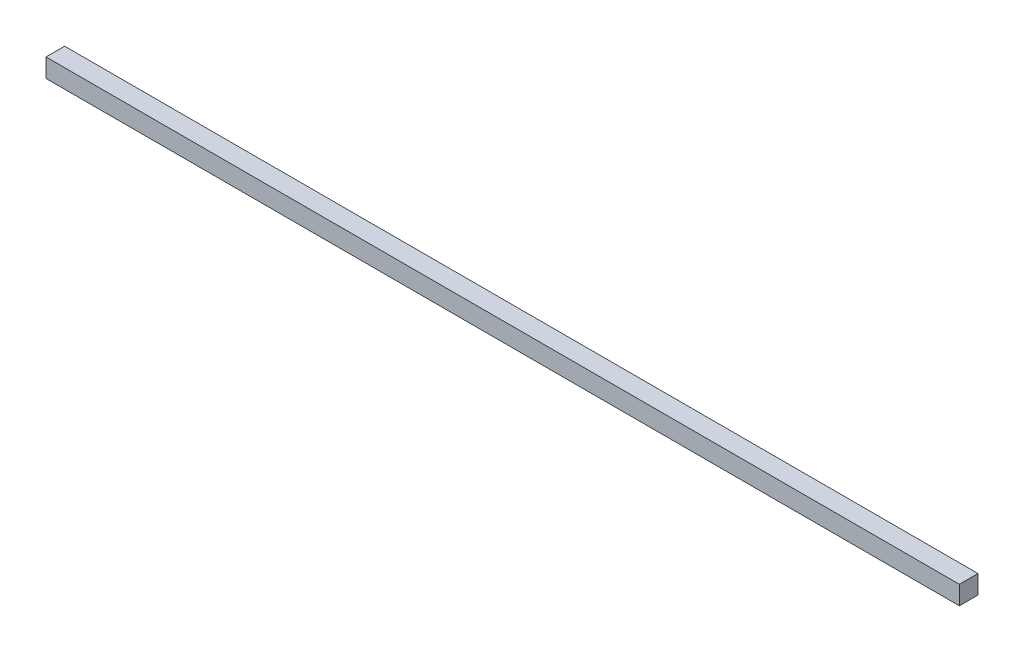
ISO-10303-21;
HEADER;
FILE_DESCRIPTION(('STEP AP214'),'2;1');
FILE_NAME('part.step','',(''),(''),'','','');
FILE_SCHEMA(('AUTOMOTIVE_DESIGN { 1 0 10303 214 1 1 1 1 }'));
ENDSEC;
DATA;
#1=APPLICATION_CONTEXT('core data for automotive mechanical design processes');
#2=APPLICATION_PROTOCOL_DEFINITION('international standard','automotive_design',2000,#1);
#3=PRODUCT_CONTEXT('',#1,'mechanical');
#4=PRODUCT('Part','Part','',(#3));
#5=PRODUCT_RELATED_PRODUCT_CATEGORY('part','',(#4));
#6=PRODUCT_DEFINITION_FORMATION('','',#4);
#7=PRODUCT_DEFINITION_CONTEXT('part definition',#1,'design');
#8=PRODUCT_DEFINITION('design','',#6,#7);
#9=PRODUCT_DEFINITION_SHAPE('','',#8);
#10=(LENGTH_UNIT() NAMED_UNIT(*) SI_UNIT(.MILLI.,.METRE.));
#11=(NAMED_UNIT(*) PLANE_ANGLE_UNIT() SI_UNIT($,.RADIAN.));
#12=(NAMED_UNIT(*) SI_UNIT($,.STERADIAN.) SOLID_ANGLE_UNIT());
#13=UNCERTAINTY_MEASURE_WITH_UNIT(LENGTH_MEASURE(1.E-05),#10,'distance_accuracy_value','');
#14=(GEOMETRIC_REPRESENTATION_CONTEXT(3) GLOBAL_UNCERTAINTY_ASSIGNED_CONTEXT((#13)) GLOBAL_UNIT_ASSIGNED_CONTEXT((#10,
#11,#12)) REPRESENTATION_CONTEXT('',''));
#15=CARTESIAN_POINT('',(0.,0.,0.));
#16=DIRECTION('',(0.,0.,1.));
#17=DIRECTION('',(1.,0.,0.));
#18=AXIS2_PLACEMENT_3D('',#15,#16,#17);
#19=CARTESIAN_POINT('',(600.,24.5,-12.25));
#20=DIRECTION('',(-1.,0.,0.));
#21=DIRECTION('',(0.,0.,1.));
#22=AXIS2_PLACEMENT_3D('',#19,#20,#21);
#23=PLANE('',#22);
#24=DIRECTION('',(0.,0.,-1.));
#25=VECTOR('',#24,1.);
#26=CARTESIAN_POINT('',(600.,0.,-12.25));
#27=LINE('',#26,#25);
#28=CARTESIAN_POINT('',(600.,0.,12.25));
#29=VERTEX_POINT('',#28);
#30=CARTESIAN_POINT('',(600.,0.,-12.25));
#31=VERTEX_POINT('',#30);
#32=EDGE_CURVE('E107',#29,#31,#27,.T.);
#33=ORIENTED_EDGE('',*,*,#32,.T.);
#34=DIRECTION('',(0.,-1.,0.));
#35=VECTOR('',#34,1.);
#36=CARTESIAN_POINT('',(600.,24.5,-12.25));
#37=LINE('',#36,#35);
#38=CARTESIAN_POINT('',(600.,24.5,-12.25));
#39=VERTEX_POINT('',#38);
#40=EDGE_CURVE('E11',#39,#31,#37,.T.);
#41=ORIENTED_EDGE('',*,*,#40,.F.);
#42=DIRECTION('',(0.,0.,-1.));
#43=VECTOR('',#42,1.);
#44=CARTESIAN_POINT('',(600.,24.5,-12.25));
#45=LINE('',#44,#43);
#46=CARTESIAN_POINT('',(600.,24.5,12.25));
#47=VERTEX_POINT('',#46);
#48=EDGE_CURVE('E91',#47,#39,#45,.T.);
#49=ORIENTED_EDGE('',*,*,#48,.F.);
#50=DIRECTION('',(0.,-1.,0.));
#51=VECTOR('',#50,1.);
#52=CARTESIAN_POINT('',(600.,24.5,12.25));
#53=LINE('',#52,#51);
#54=EDGE_CURVE('E103',#47,#29,#53,.T.);
#55=ORIENTED_EDGE('',*,*,#54,.T.);
#56=EDGE_LOOP('',(#33,#41,#49,#55));
#57=FACE_BOUND('',#56,.T.);
#58=ADVANCED_FACE('F39',(#57),#23,.F.);
#59=CARTESIAN_POINT('',(-600.,24.5,-12.25));
#60=DIRECTION('',(0.,0.,1.));
#61=DIRECTION('',(1.,0.,0.));
#62=AXIS2_PLACEMENT_3D('',#59,#60,#61);
#63=PLANE('',#62);
#64=DIRECTION('',(-1.,0.,0.));
#65=VECTOR('',#64,1.);
#66=CARTESIAN_POINT('',(-600.,0.,-12.25));
#67=LINE('',#66,#65);
#68=CARTESIAN_POINT('',(-600.,0.,-12.25));
#69=VERTEX_POINT('',#68);
#70=EDGE_CURVE('E96',#31,#69,#67,.T.);
#71=ORIENTED_EDGE('',*,*,#70,.T.);
#72=DIRECTION('',(0.,-1.,0.));
#73=VECTOR('',#72,1.);
#74=CARTESIAN_POINT('',(-600.,24.5,-12.25));
#75=LINE('',#74,#73);
#76=CARTESIAN_POINT('',(-600.,24.5,-12.25));
#77=VERTEX_POINT('',#76);
#78=EDGE_CURVE('E48',#77,#69,#75,.T.);
#79=ORIENTED_EDGE('',*,*,#78,.F.);
#80=DIRECTION('',(-1.,0.,0.));
#81=VECTOR('',#80,1.);
#82=CARTESIAN_POINT('',(-600.,24.5,-12.25));
#83=LINE('',#82,#81);
#84=EDGE_CURVE('E86',#39,#77,#83,.T.);
#85=ORIENTED_EDGE('',*,*,#84,.F.);
#86=ORIENTED_EDGE('',*,*,#40,.T.);
#87=EDGE_LOOP('',(#71,#79,#85,#86));
#88=FACE_BOUND('',#87,.T.);
#89=ADVANCED_FACE('F95',(#88),#63,.F.);
#90=CARTESIAN_POINT('',(-600.,24.5,-12.25));
#91=DIRECTION('',(1.,0.,0.));
#92=DIRECTION('',(0.,0.,-1.));
#93=AXIS2_PLACEMENT_3D('',#90,#91,#92);
#94=PLANE('',#93);
#95=DIRECTION('',(0.,0.,1.));
#96=VECTOR('',#95,1.);
#97=CARTESIAN_POINT('',(-600.,0.,-12.25));
#98=LINE('',#97,#96);
#99=CARTESIAN_POINT('',(-600.,0.,12.25));
#100=VERTEX_POINT('',#99);
#101=EDGE_CURVE('E73',#69,#100,#98,.T.);
#102=ORIENTED_EDGE('',*,*,#101,.T.);
#103=DIRECTION('',(0.,-1.,0.));
#104=VECTOR('',#103,1.);
#105=CARTESIAN_POINT('',(-600.,24.5,12.25));
#106=LINE('',#105,#104);
#107=CARTESIAN_POINT('',(-600.,24.5,12.25));
#108=VERTEX_POINT('',#107);
#109=EDGE_CURVE('E98',#108,#100,#106,.T.);
#110=ORIENTED_EDGE('',*,*,#109,.F.);
#111=DIRECTION('',(0.,0.,1.));
#112=VECTOR('',#111,1.);
#113=CARTESIAN_POINT('',(-600.,24.5,-12.25));
#114=LINE('',#113,#112);
#115=EDGE_CURVE('E89',#77,#108,#114,.T.);
#116=ORIENTED_EDGE('',*,*,#115,.F.);
#117=ORIENTED_EDGE('',*,*,#78,.T.);
#118=EDGE_LOOP('',(#102,#110,#116,#117));
#119=FACE_BOUND('',#118,.T.);
#120=ADVANCED_FACE('F99',(#119),#94,.F.);
#121=CARTESIAN_POINT('',(-600.,24.5,12.25));
#122=DIRECTION('',(0.,0.,-1.));
#123=DIRECTION('',(-1.,0.,0.));
#124=AXIS2_PLACEMENT_3D('',#121,#122,#123);
#125=PLANE('',#124);
#126=DIRECTION('',(1.,0.,0.));
#127=VECTOR('',#126,1.);
#128=CARTESIAN_POINT('',(-600.,0.,12.25));
#129=LINE('',#128,#127);
#130=EDGE_CURVE('E79',#100,#29,#129,.T.);
#131=ORIENTED_EDGE('',*,*,#130,.T.);
#132=ORIENTED_EDGE('',*,*,#54,.F.);
#133=DIRECTION('',(1.,0.,0.));
#134=VECTOR('',#133,1.);
#135=CARTESIAN_POINT('',(-600.,24.5,12.25));
#136=LINE('',#135,#134);
#137=EDGE_CURVE('E56',#108,#47,#136,.T.);
#138=ORIENTED_EDGE('',*,*,#137,.F.);
#139=ORIENTED_EDGE('',*,*,#109,.T.);
#140=EDGE_LOOP('',(#131,#132,#138,#139));
#141=FACE_BOUND('',#140,.T.);
#142=ADVANCED_FACE('F120',(#141),#125,.F.);
#143=CARTESIAN_POINT('',(0.,24.5,0.));
#144=DIRECTION('',(0.,1.,0.));
#145=DIRECTION('',(0.,0.,1.));
#146=AXIS2_PLACEMENT_3D('',#143,#144,#145);
#147=PLANE('',#146);
#148=ORIENTED_EDGE('',*,*,#48,.T.);
#149=ORIENTED_EDGE('',*,*,#84,.T.);
#150=ORIENTED_EDGE('',*,*,#115,.T.);
#151=ORIENTED_EDGE('',*,*,#137,.T.);
#152=EDGE_LOOP('',(#148,#149,#150,#151));
#153=FACE_BOUND('',#152,.T.);
#154=ADVANCED_FACE('F87',(#153),#147,.T.);
#155=CARTESIAN_POINT('',(0.,0.,0.));
#156=DIRECTION('',(0.,1.,0.));
#157=DIRECTION('',(0.,0.,1.));
#158=AXIS2_PLACEMENT_3D('',#155,#156,#157);
#159=PLANE('',#158);
#160=ORIENTED_EDGE('',*,*,#32,.F.);
#161=ORIENTED_EDGE('',*,*,#130,.F.);
#162=ORIENTED_EDGE('',*,*,#101,.F.);
#163=ORIENTED_EDGE('',*,*,#70,.F.);
#164=EDGE_LOOP('',(#160,#161,#162,#163));
#165=FACE_BOUND('',#164,.T.);
#166=ADVANCED_FACE('F123',(#165),#159,.F.);
#167=CLOSED_SHELL('',(#58,#89,#120,#142,#154,#166));
#168=MANIFOLD_SOLID_BREP('B2',#167);
#169=ADVANCED_BREP_SHAPE_REPRESENTATION('',(#18,#168),#14);
#170=SHAPE_DEFINITION_REPRESENTATION(#9,#169);
ENDSEC;
END-ISO-10303-21;
